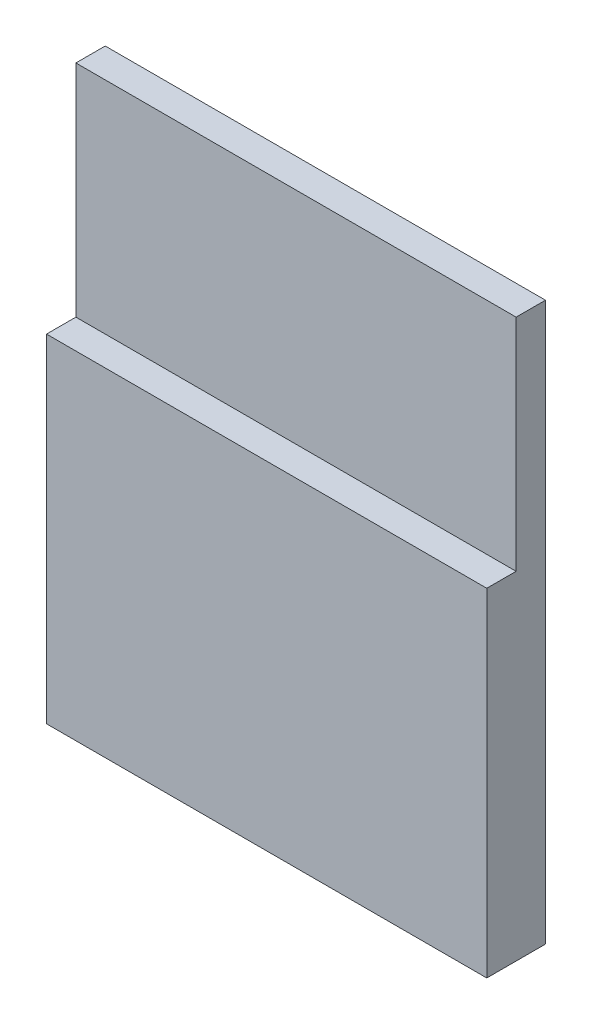
ISO-10303-21;
HEADER;
FILE_DESCRIPTION(('STEP AP214'),'2;1');
FILE_NAME('part.step','',(''),(''),'','','');
FILE_SCHEMA(('AUTOMOTIVE_DESIGN { 1 0 10303 214 1 1 1 1 }'));
ENDSEC;
DATA;
#1=APPLICATION_CONTEXT('core data for automotive mechanical design processes');
#2=APPLICATION_PROTOCOL_DEFINITION('international standard','automotive_design',2000,#1);
#3=PRODUCT_CONTEXT('',#1,'mechanical');
#4=PRODUCT('Part','Part','',(#3));
#5=PRODUCT_RELATED_PRODUCT_CATEGORY('part','',(#4));
#6=PRODUCT_DEFINITION_FORMATION('','',#4);
#7=PRODUCT_DEFINITION_CONTEXT('part definition',#1,'design');
#8=PRODUCT_DEFINITION('design','',#6,#7);
#9=PRODUCT_DEFINITION_SHAPE('','',#8);
#10=(LENGTH_UNIT() NAMED_UNIT(*) SI_UNIT(.MILLI.,.METRE.));
#11=(NAMED_UNIT(*) PLANE_ANGLE_UNIT() SI_UNIT($,.RADIAN.));
#12=(NAMED_UNIT(*) SI_UNIT($,.STERADIAN.) SOLID_ANGLE_UNIT());
#13=UNCERTAINTY_MEASURE_WITH_UNIT(LENGTH_MEASURE(1.E-05),#10,'distance_accuracy_value','');
#14=(GEOMETRIC_REPRESENTATION_CONTEXT(3) GLOBAL_UNCERTAINTY_ASSIGNED_CONTEXT((#13)) GLOBAL_UNIT_ASSIGNED_CONTEXT((#10,
#11,#12)) REPRESENTATION_CONTEXT('',''));
#15=CARTESIAN_POINT('',(0.,0.,0.));
#16=DIRECTION('',(0.,0.,1.));
#17=DIRECTION('',(1.,0.,0.));
#18=AXIS2_PLACEMENT_3D('',#15,#16,#17);
#19=CARTESIAN_POINT('',(0.,38.,2.));
#20=DIRECTION('',(0.,-1.,0.));
#21=DIRECTION('',(0.,0.,-1.));
#22=AXIS2_PLACEMENT_3D('',#19,#20,#21);
#23=PLANE('',#22);
#24=DIRECTION('',(-1.,0.,0.));
#25=VECTOR('',#24,1.);
#26=CARTESIAN_POINT('',(0.,38.,0.));
#27=LINE('',#26,#25);
#28=CARTESIAN_POINT('',(0.,38.,0.));
#29=VERTEX_POINT('',#28);
#30=CARTESIAN_POINT('',(-30.,38.,0.));
#31=VERTEX_POINT('',#30);
#32=EDGE_CURVE('E91',#29,#31,#27,.T.);
#33=ORIENTED_EDGE('',*,*,#32,.T.);
#34=DIRECTION('',(0.,0.,-1.));
#35=VECTOR('',#34,1.);
#36=CARTESIAN_POINT('',(-30.,38.,2.));
#37=LINE('',#36,#35);
#38=CARTESIAN_POINT('',(-30.,38.,2.));
#39=VERTEX_POINT('',#38);
#40=EDGE_CURVE('E11',#39,#31,#37,.T.);
#41=ORIENTED_EDGE('',*,*,#40,.F.);
#42=DIRECTION('',(-1.,0.,0.));
#43=VECTOR('',#42,1.);
#44=CARTESIAN_POINT('',(0.,38.,2.));
#45=LINE('',#44,#43);
#46=CARTESIAN_POINT('',(0.,38.,2.));
#47=VERTEX_POINT('',#46);
#48=EDGE_CURVE('E85',#47,#39,#45,.T.);
#49=ORIENTED_EDGE('',*,*,#48,.F.);
#50=DIRECTION('',(0.,0.,-1.));
#51=VECTOR('',#50,1.);
#52=CARTESIAN_POINT('',(0.,38.,2.));
#53=LINE('',#52,#51);
#54=EDGE_CURVE('E77',#47,#29,#53,.T.);
#55=ORIENTED_EDGE('',*,*,#54,.T.);
#56=EDGE_LOOP('',(#33,#41,#49,#55));
#57=FACE_BOUND('',#56,.T.);
#58=ADVANCED_FACE('F35',(#57),#23,.F.);
#59=CARTESIAN_POINT('',(-30.,38.,2.));
#60=DIRECTION('',(1.,0.,0.));
#61=DIRECTION('',(0.,1.,0.));
#62=AXIS2_PLACEMENT_3D('',#59,#60,#61);
#63=PLANE('',#62);
#64=DIRECTION('',(0.,-1.,0.));
#65=VECTOR('',#64,1.);
#66=CARTESIAN_POINT('',(-30.,38.,0.));
#67=LINE('',#66,#65);
#68=CARTESIAN_POINT('',(-30.,0.,0.));
#69=VERTEX_POINT('',#68);
#70=EDGE_CURVE('E94',#31,#69,#67,.T.);
#71=ORIENTED_EDGE('',*,*,#70,.T.);
#72=DIRECTION('',(0.,0.,-1.));
#73=VECTOR('',#72,1.);
#74=CARTESIAN_POINT('',(-30.,0.,2.));
#75=LINE('',#74,#73);
#76=CARTESIAN_POINT('',(-30.,0.,4.));
#77=VERTEX_POINT('',#76);
#78=EDGE_CURVE('E42',#77,#69,#75,.T.);
#79=ORIENTED_EDGE('',*,*,#78,.F.);
#80=DIRECTION('',(0.,-1.,0.));
#81=VECTOR('',#80,1.);
#82=CARTESIAN_POINT('',(-30.,23.,4.));
#83=LINE('',#82,#81);
#84=CARTESIAN_POINT('',(-30.,23.,4.));
#85=VERTEX_POINT('',#84);
#86=EDGE_CURVE('E118',#85,#77,#83,.T.);
#87=ORIENTED_EDGE('',*,*,#86,.F.);
#88=DIRECTION('',(0.,0.,-1.));
#89=VECTOR('',#88,1.);
#90=CARTESIAN_POINT('',(-30.,23.,4.));
#91=LINE('',#90,#89);
#92=CARTESIAN_POINT('',(-30.,23.,2.));
#93=VERTEX_POINT('',#92);
#94=EDGE_CURVE('E99',#85,#93,#91,.T.);
#95=ORIENTED_EDGE('',*,*,#94,.T.);
#96=DIRECTION('',(0.,-1.,0.));
#97=VECTOR('',#96,1.);
#98=CARTESIAN_POINT('',(-30.,38.,2.));
#99=LINE('',#98,#97);
#100=EDGE_CURVE('E141',#39,#93,#99,.T.);
#101=ORIENTED_EDGE('',*,*,#100,.F.);
#102=ORIENTED_EDGE('',*,*,#40,.T.);
#103=EDGE_LOOP('',(#71,#79,#87,#95,#101,#102));
#104=FACE_BOUND('',#103,.T.);
#105=ADVANCED_FACE('F116',(#104),#63,.F.);
#106=CARTESIAN_POINT('',(-30.,0.,2.));
#107=DIRECTION('',(0.,1.,0.));
#108=DIRECTION('',(0.,0.,1.));
#109=AXIS2_PLACEMENT_3D('',#106,#107,#108);
#110=PLANE('',#109);
#111=DIRECTION('',(1.,0.,0.));
#112=VECTOR('',#111,1.);
#113=CARTESIAN_POINT('',(-30.,0.,0.));
#114=LINE('',#113,#112);
#115=CARTESIAN_POINT('',(0.,0.,0.));
#116=VERTEX_POINT('',#115);
#117=EDGE_CURVE('E86',#69,#116,#114,.T.);
#118=ORIENTED_EDGE('',*,*,#117,.T.);
#119=DIRECTION('',(0.,0.,-1.));
#120=VECTOR('',#119,1.);
#121=CARTESIAN_POINT('',(0.,0.,2.));
#122=LINE('',#121,#120);
#123=CARTESIAN_POINT('',(0.,0.,4.));
#124=VERTEX_POINT('',#123);
#125=EDGE_CURVE('E81',#124,#116,#122,.T.);
#126=ORIENTED_EDGE('',*,*,#125,.F.);
#127=DIRECTION('',(1.,0.,0.));
#128=VECTOR('',#127,1.);
#129=CARTESIAN_POINT('',(-30.,0.,4.));
#130=LINE('',#129,#128);
#131=EDGE_CURVE('E112',#77,#124,#130,.T.);
#132=ORIENTED_EDGE('',*,*,#131,.F.);
#133=ORIENTED_EDGE('',*,*,#78,.T.);
#134=EDGE_LOOP('',(#118,#126,#132,#133));
#135=FACE_BOUND('',#134,.T.);
#136=ADVANCED_FACE('F109',(#135),#110,.F.);
#137=CARTESIAN_POINT('',(0.,0.,2.));
#138=DIRECTION('',(-1.,0.,0.));
#139=DIRECTION('',(0.,0.,1.));
#140=AXIS2_PLACEMENT_3D('',#137,#138,#139);
#141=PLANE('',#140);
#142=DIRECTION('',(0.,1.,0.));
#143=VECTOR('',#142,1.);
#144=CARTESIAN_POINT('',(0.,0.,0.));
#145=LINE('',#144,#143);
#146=EDGE_CURVE('E74',#116,#29,#145,.T.);
#147=ORIENTED_EDGE('',*,*,#146,.T.);
#148=ORIENTED_EDGE('',*,*,#54,.F.);
#149=DIRECTION('',(0.,1.,0.));
#150=VECTOR('',#149,1.);
#151=CARTESIAN_POINT('',(0.,0.,2.));
#152=LINE('',#151,#150);
#153=CARTESIAN_POINT('',(0.,23.,2.));
#154=VERTEX_POINT('',#153);
#155=EDGE_CURVE('E54',#154,#47,#152,.T.);
#156=ORIENTED_EDGE('',*,*,#155,.F.);
#157=DIRECTION('',(0.,0.,-1.));
#158=VECTOR('',#157,1.);
#159=CARTESIAN_POINT('',(0.,23.,4.));
#160=LINE('',#159,#158);
#161=CARTESIAN_POINT('',(0.,23.,4.));
#162=VERTEX_POINT('',#161);
#163=EDGE_CURVE('E95',#162,#154,#160,.T.);
#164=ORIENTED_EDGE('',*,*,#163,.F.);
#165=DIRECTION('',(0.,1.,0.));
#166=VECTOR('',#165,1.);
#167=CARTESIAN_POINT('',(0.,0.,4.));
#168=LINE('',#167,#166);
#169=EDGE_CURVE('E133',#124,#162,#168,.T.);
#170=ORIENTED_EDGE('',*,*,#169,.F.);
#171=ORIENTED_EDGE('',*,*,#125,.T.);
#172=EDGE_LOOP('',(#147,#148,#156,#164,#170,#171));
#173=FACE_BOUND('',#172,.T.);
#174=ADVANCED_FACE('F76',(#173),#141,.F.);
#175=CARTESIAN_POINT('',(0.,0.,2.));
#176=DIRECTION('',(0.,0.,1.));
#177=DIRECTION('',(1.,0.,0.));
#178=AXIS2_PLACEMENT_3D('',#175,#176,#177);
#179=PLANE('',#178);
#180=DIRECTION('',(-1.,0.,0.));
#181=VECTOR('',#180,1.);
#182=CARTESIAN_POINT('',(0.,23.,2.));
#183=LINE('',#182,#181);
#184=EDGE_CURVE('E49',#154,#93,#183,.T.);
#185=ORIENTED_EDGE('',*,*,#184,.F.);
#186=ORIENTED_EDGE('',*,*,#155,.T.);
#187=ORIENTED_EDGE('',*,*,#48,.T.);
#188=ORIENTED_EDGE('',*,*,#100,.T.);
#189=EDGE_LOOP('',(#185,#186,#187,#188));
#190=FACE_BOUND('',#189,.T.);
#191=ADVANCED_FACE('F142',(#190),#179,.T.);
#192=CARTESIAN_POINT('',(0.,0.,0.));
#193=DIRECTION('',(0.,0.,1.));
#194=DIRECTION('',(1.,0.,0.));
#195=AXIS2_PLACEMENT_3D('',#192,#193,#194);
#196=PLANE('',#195);
#197=ORIENTED_EDGE('',*,*,#32,.F.);
#198=ORIENTED_EDGE('',*,*,#146,.F.);
#199=ORIENTED_EDGE('',*,*,#117,.F.);
#200=ORIENTED_EDGE('',*,*,#70,.F.);
#201=EDGE_LOOP('',(#197,#198,#199,#200));
#202=FACE_BOUND('',#201,.T.);
#203=ADVANCED_FACE('F93',(#202),#196,.F.);
#204=CARTESIAN_POINT('',(0.,23.,4.));
#205=DIRECTION('',(0.,-1.,0.));
#206=DIRECTION('',(0.,0.,-1.));
#207=AXIS2_PLACEMENT_3D('',#204,#205,#206);
#208=PLANE('',#207);
#209=ORIENTED_EDGE('',*,*,#184,.T.);
#210=ORIENTED_EDGE('',*,*,#94,.F.);
#211=DIRECTION('',(-1.,0.,0.));
#212=VECTOR('',#211,1.);
#213=CARTESIAN_POINT('',(0.,23.,4.));
#214=LINE('',#213,#212);
#215=EDGE_CURVE('E130',#162,#85,#214,.T.);
#216=ORIENTED_EDGE('',*,*,#215,.F.);
#217=ORIENTED_EDGE('',*,*,#163,.T.);
#218=EDGE_LOOP('',(#209,#210,#216,#217));
#219=FACE_BOUND('',#218,.T.);
#220=ADVANCED_FACE('F137',(#219),#208,.F.);
#221=CARTESIAN_POINT('',(0.,0.,4.));
#222=DIRECTION('',(0.,0.,1.));
#223=DIRECTION('',(1.,0.,0.));
#224=AXIS2_PLACEMENT_3D('',#221,#222,#223);
#225=PLANE('',#224);
#226=ORIENTED_EDGE('',*,*,#86,.T.);
#227=ORIENTED_EDGE('',*,*,#131,.T.);
#228=ORIENTED_EDGE('',*,*,#169,.T.);
#229=ORIENTED_EDGE('',*,*,#215,.T.);
#230=EDGE_LOOP('',(#226,#227,#228,#229));
#231=FACE_BOUND('',#230,.T.);
#232=ADVANCED_FACE('F132',(#231),#225,.T.);
#233=CLOSED_SHELL('',(#58,#105,#136,#174,#191,#203,#220,#232));
#234=MANIFOLD_SOLID_BREP('B2',#233);
#235=ADVANCED_BREP_SHAPE_REPRESENTATION('',(#18,#234),#14);
#236=SHAPE_DEFINITION_REPRESENTATION(#9,#235);
ENDSEC;
END-ISO-10303-21;
